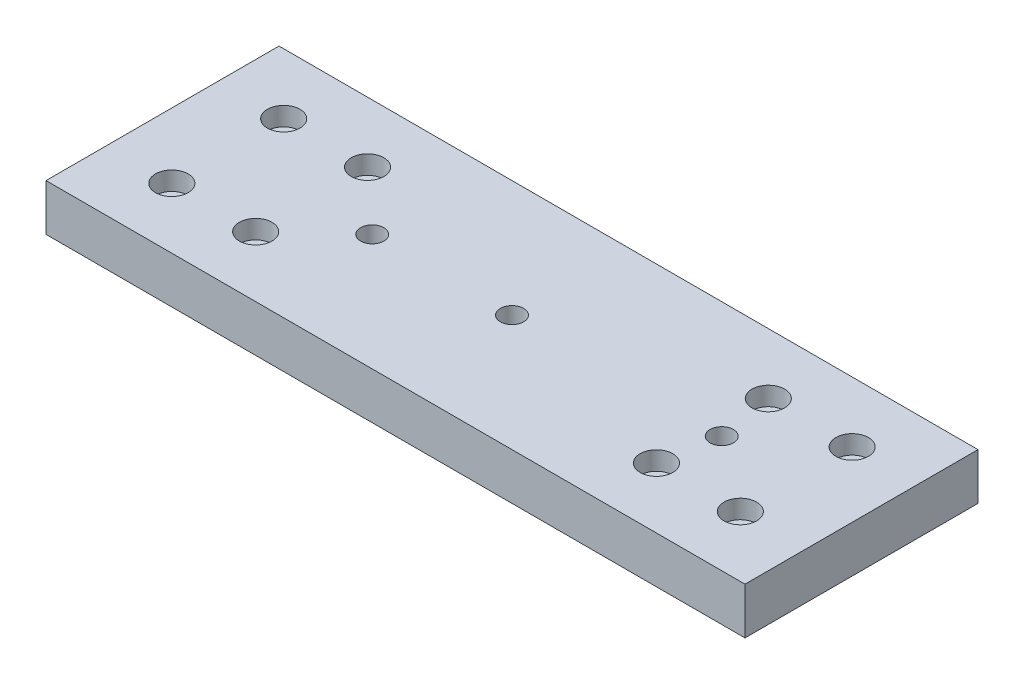
ISO-10303-21;
HEADER;
FILE_DESCRIPTION(('STEP AP214'),'2;1');
FILE_NAME('part.step','',(''),(''),'','','');
FILE_SCHEMA(('AUTOMOTIVE_DESIGN { 1 0 10303 214 1 1 1 1 }'));
ENDSEC;
DATA;
#1=APPLICATION_CONTEXT('core data for automotive mechanical design processes');
#2=APPLICATION_PROTOCOL_DEFINITION('international standard','automotive_design',2000,#1);
#3=PRODUCT_CONTEXT('',#1,'mechanical');
#4=PRODUCT('Part','Part','',(#3));
#5=PRODUCT_RELATED_PRODUCT_CATEGORY('part','',(#4));
#6=PRODUCT_DEFINITION_FORMATION('','',#4);
#7=PRODUCT_DEFINITION_CONTEXT('part definition',#1,'design');
#8=PRODUCT_DEFINITION('design','',#6,#7);
#9=PRODUCT_DEFINITION_SHAPE('','',#8);
#10=(LENGTH_UNIT() NAMED_UNIT(*) SI_UNIT(.MILLI.,.METRE.));
#11=(NAMED_UNIT(*) PLANE_ANGLE_UNIT() SI_UNIT($,.RADIAN.));
#12=(NAMED_UNIT(*) SI_UNIT($,.STERADIAN.) SOLID_ANGLE_UNIT());
#13=UNCERTAINTY_MEASURE_WITH_UNIT(LENGTH_MEASURE(1.E-05),#10,'distance_accuracy_value','');
#14=(GEOMETRIC_REPRESENTATION_CONTEXT(3) GLOBAL_UNCERTAINTY_ASSIGNED_CONTEXT((#13)) GLOBAL_UNIT_ASSIGNED_CONTEXT((#10,
#11,#12)) REPRESENTATION_CONTEXT('',''));
#15=CARTESIAN_POINT('',(0.,0.,0.));
#16=DIRECTION('',(0.,0.,1.));
#17=DIRECTION('',(1.,0.,0.));
#18=AXIS2_PLACEMENT_3D('',#15,#16,#17);
#19=CARTESIAN_POINT('',(-60.9999999999994,0.,-11.9999999999998));
#20=DIRECTION('',(0.,1.,0.));
#21=DIRECTION('',(0.,0.,1.));
#22=AXIS2_PLACEMENT_3D('',#19,#20,#21);
#23=CYLINDRICAL_SURFACE('',#22,1.5);
#24=CARTESIAN_POINT('',(-60.9999999999994,0.,-11.9999999999998));
#25=DIRECTION('',(0.,1.,0.));
#26=DIRECTION('',(0.,0.,1.));
#27=AXIS2_PLACEMENT_3D('',#24,#25,#26);
#28=CIRCLE('',#27,1.5);
#29=CARTESIAN_POINT('',(-60.9999999999994,0.,-10.4999999999998));
#30=VERTEX_POINT('',#29);
#31=EDGE_CURVE('E172',#30,#30,#28,.T.);
#32=ORIENTED_EDGE('',*,*,#31,.F.);
#33=EDGE_LOOP('',(#32));
#34=FACE_BOUND('',#33,.T.);
#35=CARTESIAN_POINT('',(-60.9999999999994,6.,-11.9999999999998));
#36=DIRECTION('',(0.,1.,0.));
#37=DIRECTION('',(0.,0.,1.));
#38=AXIS2_PLACEMENT_3D('',#35,#36,#37);
#39=CIRCLE('',#38,1.5);
#40=CARTESIAN_POINT('',(-60.9999999999994,6.,-10.4999999999998));
#41=VERTEX_POINT('',#40);
#42=EDGE_CURVE('E142',#41,#41,#39,.F.);
#43=ORIENTED_EDGE('',*,*,#42,.F.);
#44=EDGE_LOOP('',(#43));
#45=FACE_BOUND('',#44,.T.);
#46=ADVANCED_FACE('F37',(#34,#45),#23,.F.);
#47=CARTESIAN_POINT('',(-42.9999999999994,0.,-11.9999999999998));
#48=DIRECTION('',(0.,1.,0.));
#49=DIRECTION('',(0.,0.,1.));
#50=AXIS2_PLACEMENT_3D('',#47,#48,#49);
#51=CYLINDRICAL_SURFACE('',#50,1.5);
#52=CARTESIAN_POINT('',(-42.9999999999994,0.,-11.9999999999998));
#53=DIRECTION('',(0.,1.,0.));
#54=DIRECTION('',(0.,0.,1.));
#55=AXIS2_PLACEMENT_3D('',#52,#53,#54);
#56=CIRCLE('',#55,1.5);
#57=CARTESIAN_POINT('',(-42.9999999999994,0.,-10.4999999999998));
#58=VERTEX_POINT('',#57);
#59=EDGE_CURVE('E168',#58,#58,#56,.T.);
#60=ORIENTED_EDGE('',*,*,#59,.F.);
#61=EDGE_LOOP('',(#60));
#62=FACE_BOUND('',#61,.T.);
#63=CARTESIAN_POINT('',(-42.9999999999994,6.,-11.9999999999998));
#64=DIRECTION('',(0.,1.,0.));
#65=DIRECTION('',(0.,0.,1.));
#66=AXIS2_PLACEMENT_3D('',#63,#64,#65);
#67=CIRCLE('',#66,1.5);
#68=CARTESIAN_POINT('',(-42.9999999999994,6.,-10.4999999999998));
#69=VERTEX_POINT('',#68);
#70=EDGE_CURVE('E137',#69,#69,#67,.F.);
#71=ORIENTED_EDGE('',*,*,#70,.F.);
#72=EDGE_LOOP('',(#71));
#73=FACE_BOUND('',#72,.T.);
#74=ADVANCED_FACE('F211',(#62,#73),#51,.F.);
#75=CARTESIAN_POINT('',(60.9999999999994,0.,11.9999999999998));
#76=DIRECTION('',(0.,1.,0.));
#77=DIRECTION('',(0.,0.,1.));
#78=AXIS2_PLACEMENT_3D('',#75,#76,#77);
#79=CYLINDRICAL_SURFACE('',#78,1.5);
#80=CARTESIAN_POINT('',(60.9999999999994,0.,11.9999999999998));
#81=DIRECTION('',(0.,1.,0.));
#82=DIRECTION('',(0.,0.,1.));
#83=AXIS2_PLACEMENT_3D('',#80,#81,#82);
#84=CIRCLE('',#83,1.5);
#85=CARTESIAN_POINT('',(60.9999999999994,0.,13.4999999999998));
#86=VERTEX_POINT('',#85);
#87=EDGE_CURVE('E184',#86,#86,#84,.T.);
#88=ORIENTED_EDGE('',*,*,#87,.F.);
#89=EDGE_LOOP('',(#88));
#90=FACE_BOUND('',#89,.T.);
#91=CARTESIAN_POINT('',(60.9999999999994,6.,11.9999999999998));
#92=DIRECTION('',(0.,1.,0.));
#93=DIRECTION('',(0.,0.,1.));
#94=AXIS2_PLACEMENT_3D('',#91,#92,#93);
#95=CIRCLE('',#94,1.5);
#96=CARTESIAN_POINT('',(60.9999999999994,6.,13.4999999999998));
#97=VERTEX_POINT('',#96);
#98=EDGE_CURVE('E131',#97,#97,#95,.F.);
#99=ORIENTED_EDGE('',*,*,#98,.F.);
#100=EDGE_LOOP('',(#99));
#101=FACE_BOUND('',#100,.T.);
#102=ADVANCED_FACE('F217',(#90,#101),#79,.F.);
#103=CARTESIAN_POINT('',(42.9999999999994,0.,11.9999999999998));
#104=DIRECTION('',(0.,1.,0.));
#105=DIRECTION('',(0.,0.,1.));
#106=AXIS2_PLACEMENT_3D('',#103,#104,#105);
#107=CYLINDRICAL_SURFACE('',#106,1.5);
#108=CARTESIAN_POINT('',(42.9999999999994,0.,11.9999999999998));
#109=DIRECTION('',(0.,1.,0.));
#110=DIRECTION('',(0.,0.,1.));
#111=AXIS2_PLACEMENT_3D('',#108,#109,#110);
#112=CIRCLE('',#111,1.5);
#113=CARTESIAN_POINT('',(42.9999999999994,0.,13.4999999999998));
#114=VERTEX_POINT('',#113);
#115=EDGE_CURVE('E181',#114,#114,#112,.T.);
#116=ORIENTED_EDGE('',*,*,#115,.F.);
#117=EDGE_LOOP('',(#116));
#118=FACE_BOUND('',#117,.T.);
#119=CARTESIAN_POINT('',(42.9999999999994,6.,11.9999999999998));
#120=DIRECTION('',(0.,1.,0.));
#121=DIRECTION('',(0.,0.,1.));
#122=AXIS2_PLACEMENT_3D('',#119,#120,#121);
#123=CIRCLE('',#122,1.5);
#124=CARTESIAN_POINT('',(42.9999999999994,6.,13.4999999999998));
#125=VERTEX_POINT('',#124);
#126=EDGE_CURVE('E127',#125,#125,#123,.F.);
#127=ORIENTED_EDGE('',*,*,#126,.F.);
#128=EDGE_LOOP('',(#127));
#129=FACE_BOUND('',#128,.T.);
#130=ADVANCED_FACE('F229',(#118,#129),#107,.F.);
#131=CARTESIAN_POINT('',(0.,10.,0.));
#132=DIRECTION('',(0.,-1.,0.));
#133=DIRECTION('',(0.,0.,-1.));
#134=AXIS2_PLACEMENT_3D('',#131,#132,#133);
#135=CYLINDRICAL_SURFACE('',#134,2.5);
#136=CARTESIAN_POINT('',(0.,10.,0.));
#137=DIRECTION('',(0.,-1.,0.));
#138=DIRECTION('',(0.,0.,-1.));
#139=AXIS2_PLACEMENT_3D('',#136,#137,#138);
#140=CIRCLE('',#139,2.5);
#141=CARTESIAN_POINT('',(0.,10.,-2.5));
#142=VERTEX_POINT('',#141);
#143=EDGE_CURVE('E163',#142,#142,#140,.T.);
#144=ORIENTED_EDGE('',*,*,#143,.F.);
#145=EDGE_LOOP('',(#144));
#146=FACE_BOUND('',#145,.T.);
#147=CARTESIAN_POINT('',(0.,5.,0.));
#148=DIRECTION('',(0.,-1.,0.));
#149=DIRECTION('',(0.,0.,-1.));
#150=AXIS2_PLACEMENT_3D('',#147,#148,#149);
#151=CIRCLE('',#150,2.5);
#152=CARTESIAN_POINT('',(0.,5.,-2.5));
#153=VERTEX_POINT('',#152);
#154=EDGE_CURVE('E120',#153,#153,#151,.F.);
#155=ORIENTED_EDGE('',*,*,#154,.F.);
#156=EDGE_LOOP('',(#155));
#157=FACE_BOUND('',#156,.T.);
#158=ADVANCED_FACE('F232',(#146,#157),#135,.F.);
#159=CARTESIAN_POINT('',(44.9999999999984,10.,0.));
#160=DIRECTION('',(0.,-1.,0.));
#161=DIRECTION('',(0.,0.,-1.));
#162=AXIS2_PLACEMENT_3D('',#159,#160,#161);
#163=CYLINDRICAL_SURFACE('',#162,2.5);
#164=CARTESIAN_POINT('',(44.9999999999984,10.,0.));
#165=DIRECTION('',(0.,-1.,0.));
#166=DIRECTION('',(0.,0.,-1.));
#167=AXIS2_PLACEMENT_3D('',#164,#165,#166);
#168=CIRCLE('',#167,2.5);
#169=CARTESIAN_POINT('',(44.9999999999984,10.,-2.5));
#170=VERTEX_POINT('',#169);
#171=EDGE_CURVE('E160',#170,#170,#168,.T.);
#172=ORIENTED_EDGE('',*,*,#171,.F.);
#173=EDGE_LOOP('',(#172));
#174=FACE_BOUND('',#173,.T.);
#175=CARTESIAN_POINT('',(44.9999999999984,5.,0.));
#176=DIRECTION('',(0.,-1.,0.));
#177=DIRECTION('',(0.,0.,-1.));
#178=AXIS2_PLACEMENT_3D('',#175,#176,#177);
#179=CIRCLE('',#178,2.5);
#180=CARTESIAN_POINT('',(44.9999999999984,5.,-2.5));
#181=VERTEX_POINT('',#180);
#182=EDGE_CURVE('E116',#181,#181,#179,.F.);
#183=ORIENTED_EDGE('',*,*,#182,.F.);
#184=EDGE_LOOP('',(#183));
#185=FACE_BOUND('',#184,.T.);
#186=ADVANCED_FACE('F315',(#174,#185),#163,.F.);
#187=CARTESIAN_POINT('',(-30.,10.,0.));
#188=DIRECTION('',(0.,-1.,0.));
#189=DIRECTION('',(0.,0.,-1.));
#190=AXIS2_PLACEMENT_3D('',#187,#188,#189);
#191=CYLINDRICAL_SURFACE('',#190,2.5);
#192=CARTESIAN_POINT('',(-30.,10.,0.));
#193=DIRECTION('',(0.,-1.,0.));
#194=DIRECTION('',(0.,0.,-1.));
#195=AXIS2_PLACEMENT_3D('',#192,#193,#194);
#196=CIRCLE('',#195,2.5);
#197=CARTESIAN_POINT('',(-30.,10.,-2.5));
#198=VERTEX_POINT('',#197);
#199=EDGE_CURVE('E123',#198,#198,#196,.T.);
#200=ORIENTED_EDGE('',*,*,#199,.F.);
#201=EDGE_LOOP('',(#200));
#202=FACE_BOUND('',#201,.T.);
#203=CARTESIAN_POINT('',(-30.,5.,0.));
#204=DIRECTION('',(0.,-1.,0.));
#205=DIRECTION('',(0.,0.,-1.));
#206=AXIS2_PLACEMENT_3D('',#203,#204,#205);
#207=CIRCLE('',#206,2.5);
#208=CARTESIAN_POINT('',(-30.,5.,-2.5));
#209=VERTEX_POINT('',#208);
#210=EDGE_CURVE('E113',#209,#209,#207,.F.);
#211=ORIENTED_EDGE('',*,*,#210,.F.);
#212=EDGE_LOOP('',(#211));
#213=FACE_BOUND('',#212,.T.);
#214=ADVANCED_FACE('F318',(#202,#213),#191,.F.);
#215=CARTESIAN_POINT('',(-75.,10.,25.));
#216=DIRECTION('',(1.,0.,0.));
#217=DIRECTION('',(0.,0.,-1.));
#218=AXIS2_PLACEMENT_3D('',#215,#216,#217);
#219=PLANE('',#218);
#220=DIRECTION('',(0.,0.,1.));
#221=VECTOR('',#220,1.);
#222=CARTESIAN_POINT('',(-75.,0.,25.));
#223=LINE('',#222,#221);
#224=CARTESIAN_POINT('',(-75.,0.,-25.));
#225=VERTEX_POINT('',#224);
#226=CARTESIAN_POINT('',(-75.,0.,25.));
#227=VERTEX_POINT('',#226);
#228=EDGE_CURVE('E104',#225,#227,#223,.T.);
#229=ORIENTED_EDGE('',*,*,#228,.T.);
#230=DIRECTION('',(0.,-1.,0.));
#231=VECTOR('',#230,1.);
#232=CARTESIAN_POINT('',(-75.,10.,25.));
#233=LINE('',#232,#231);
#234=CARTESIAN_POINT('',(-75.,10.,25.));
#235=VERTEX_POINT('',#234);
#236=EDGE_CURVE('E11',#235,#227,#233,.T.);
#237=ORIENTED_EDGE('',*,*,#236,.F.);
#238=DIRECTION('',(0.,0.,1.));
#239=VECTOR('',#238,1.);
#240=CARTESIAN_POINT('',(-75.,10.,25.));
#241=LINE('',#240,#239);
#242=CARTESIAN_POINT('',(-75.,10.,-25.));
#243=VERTEX_POINT('',#242);
#244=EDGE_CURVE('E91',#243,#235,#241,.T.);
#245=ORIENTED_EDGE('',*,*,#244,.F.);
#246=DIRECTION('',(0.,-1.,0.));
#247=VECTOR('',#246,1.);
#248=CARTESIAN_POINT('',(-75.,10.,-25.));
#249=LINE('',#248,#247);
#250=EDGE_CURVE('E100',#243,#225,#249,.T.);
#251=ORIENTED_EDGE('',*,*,#250,.T.);
#252=EDGE_LOOP('',(#229,#237,#245,#251));
#253=FACE_BOUND('',#252,.T.);
#254=ADVANCED_FACE('F39',(#253),#219,.F.);
#255=CARTESIAN_POINT('',(75.,10.,25.));
#256=DIRECTION('',(0.,0.,-1.));
#257=DIRECTION('',(-1.,0.,0.));
#258=AXIS2_PLACEMENT_3D('',#255,#256,#257);
#259=PLANE('',#258);
#260=DIRECTION('',(1.,0.,0.));
#261=VECTOR('',#260,1.);
#262=CARTESIAN_POINT('',(75.,0.,25.));
#263=LINE('',#262,#261);
#264=CARTESIAN_POINT('',(75.,0.,25.));
#265=VERTEX_POINT('',#264);
#266=EDGE_CURVE('E95',#227,#265,#263,.T.);
#267=ORIENTED_EDGE('',*,*,#266,.T.);
#268=DIRECTION('',(0.,-1.,0.));
#269=VECTOR('',#268,1.);
#270=CARTESIAN_POINT('',(75.,10.,25.));
#271=LINE('',#270,#269);
#272=CARTESIAN_POINT('',(75.,10.,25.));
#273=VERTEX_POINT('',#272);
#274=EDGE_CURVE('E47',#273,#265,#271,.T.);
#275=ORIENTED_EDGE('',*,*,#274,.F.);
#276=DIRECTION('',(1.,0.,0.));
#277=VECTOR('',#276,1.);
#278=CARTESIAN_POINT('',(75.,10.,25.));
#279=LINE('',#278,#277);
#280=EDGE_CURVE('E86',#235,#273,#279,.T.);
#281=ORIENTED_EDGE('',*,*,#280,.F.);
#282=ORIENTED_EDGE('',*,*,#236,.T.);
#283=EDGE_LOOP('',(#267,#275,#281,#282));
#284=FACE_BOUND('',#283,.T.);
#285=ADVANCED_FACE('F94',(#284),#259,.F.);
#286=CARTESIAN_POINT('',(75.,10.,25.));
#287=DIRECTION('',(-1.,0.,0.));
#288=DIRECTION('',(0.,0.,1.));
#289=AXIS2_PLACEMENT_3D('',#286,#287,#288);
#290=PLANE('',#289);
#291=DIRECTION('',(0.,0.,-1.));
#292=VECTOR('',#291,1.);
#293=CARTESIAN_POINT('',(75.,0.,25.));
#294=LINE('',#293,#292);
#295=CARTESIAN_POINT('',(75.,0.,-25.));
#296=VERTEX_POINT('',#295);
#297=EDGE_CURVE('E73',#265,#296,#294,.T.);
#298=ORIENTED_EDGE('',*,*,#297,.T.);
#299=DIRECTION('',(0.,-1.,0.));
#300=VECTOR('',#299,1.);
#301=CARTESIAN_POINT('',(75.,10.,-25.));
#302=LINE('',#301,#300);
#303=CARTESIAN_POINT('',(75.,10.,-25.));
#304=VERTEX_POINT('',#303);
#305=EDGE_CURVE('E96',#304,#296,#302,.T.);
#306=ORIENTED_EDGE('',*,*,#305,.F.);
#307=DIRECTION('',(0.,0.,-1.));
#308=VECTOR('',#307,1.);
#309=CARTESIAN_POINT('',(75.,10.,25.));
#310=LINE('',#309,#308);
#311=EDGE_CURVE('E89',#273,#304,#310,.T.);
#312=ORIENTED_EDGE('',*,*,#311,.F.);
#313=ORIENTED_EDGE('',*,*,#274,.T.);
#314=EDGE_LOOP('',(#298,#306,#312,#313));
#315=FACE_BOUND('',#314,.T.);
#316=ADVANCED_FACE('F98',(#315),#290,.F.);
#317=CARTESIAN_POINT('',(75.,10.,-25.));
#318=DIRECTION('',(0.,0.,1.));
#319=DIRECTION('',(1.,0.,0.));
#320=AXIS2_PLACEMENT_3D('',#317,#318,#319);
#321=PLANE('',#320);
#322=DIRECTION('',(-1.,0.,0.));
#323=VECTOR('',#322,1.);
#324=CARTESIAN_POINT('',(75.,0.,-25.));
#325=LINE('',#324,#323);
#326=EDGE_CURVE('E79',#296,#225,#325,.T.);
#327=ORIENTED_EDGE('',*,*,#326,.T.);
#328=ORIENTED_EDGE('',*,*,#250,.F.);
#329=DIRECTION('',(-1.,0.,0.));
#330=VECTOR('',#329,1.);
#331=CARTESIAN_POINT('',(75.,10.,-25.));
#332=LINE('',#331,#330);
#333=EDGE_CURVE('E56',#304,#243,#332,.T.);
#334=ORIENTED_EDGE('',*,*,#333,.F.);
#335=ORIENTED_EDGE('',*,*,#305,.T.);
#336=EDGE_LOOP('',(#327,#328,#334,#335));
#337=FACE_BOUND('',#336,.T.);
#338=ADVANCED_FACE('F332',(#337),#321,.F.);
#339=CARTESIAN_POINT('',(0.,10.,0.));
#340=DIRECTION('',(0.,1.,0.));
#341=DIRECTION('',(0.,0.,1.));
#342=AXIS2_PLACEMENT_3D('',#339,#340,#341);
#343=PLANE('',#342);
#344=CARTESIAN_POINT('',(60.9999999999994,10.,11.9999999999998));
#345=DIRECTION('',(0.,1.,0.));
#346=DIRECTION('',(0.,0.,1.));
#347=AXIS2_PLACEMENT_3D('',#344,#345,#346);
#348=CIRCLE('',#347,3.50000000000001);
#349=CARTESIAN_POINT('',(60.9999999999994,10.,15.4999999999998));
#350=VERTEX_POINT('',#349);
#351=EDGE_CURVE('E570',#350,#350,#348,.T.);
#352=ORIENTED_EDGE('',*,*,#351,.F.);
#353=EDGE_LOOP('',(#352));
#354=FACE_BOUND('',#353,.T.);
#355=CARTESIAN_POINT('',(-60.9999999999994,10.,11.9999999999998));
#356=DIRECTION('',(0.,1.,0.));
#357=DIRECTION('',(0.,0.,-1.));
#358=AXIS2_PLACEMENT_3D('',#355,#356,#357);
#359=CIRCLE('',#358,3.5);
#360=CARTESIAN_POINT('',(-60.9999999999994,10.,8.49999999999979));
#361=VERTEX_POINT('',#360);
#362=EDGE_CURVE('E564',#361,#361,#359,.T.);
#363=ORIENTED_EDGE('',*,*,#362,.F.);
#364=EDGE_LOOP('',(#363));
#365=FACE_BOUND('',#364,.T.);
#366=CARTESIAN_POINT('',(-42.9999999999994,10.,11.9999999999998));
#367=DIRECTION('',(0.,1.,0.));
#368=DIRECTION('',(0.,0.,-1.));
#369=AXIS2_PLACEMENT_3D('',#366,#367,#368);
#370=CIRCLE('',#369,3.5);
#371=CARTESIAN_POINT('',(-42.9999999999994,10.,8.49999999999978));
#372=VERTEX_POINT('',#371);
#373=EDGE_CURVE('E563',#372,#372,#370,.T.);
#374=ORIENTED_EDGE('',*,*,#373,.F.);
#375=EDGE_LOOP('',(#374));
#376=FACE_BOUND('',#375,.T.);
#377=CARTESIAN_POINT('',(-42.9999999999994,10.,-11.9999999999998));
#378=DIRECTION('',(0.,1.,0.));
#379=DIRECTION('',(0.,0.,1.));
#380=AXIS2_PLACEMENT_3D('',#377,#378,#379);
#381=CIRCLE('',#380,3.5);
#382=CARTESIAN_POINT('',(-42.9999999999994,10.,-8.49999999999977));
#383=VERTEX_POINT('',#382);
#384=EDGE_CURVE('E577',#383,#383,#381,.T.);
#385=ORIENTED_EDGE('',*,*,#384,.F.);
#386=EDGE_LOOP('',(#385));
#387=FACE_BOUND('',#386,.T.);
#388=CARTESIAN_POINT('',(42.9999999999995,10.,11.9999999999998));
#389=DIRECTION('',(0.,1.,0.));
#390=DIRECTION('',(0.,0.,1.));
#391=AXIS2_PLACEMENT_3D('',#388,#389,#390);
#392=CIRCLE('',#391,3.5);
#393=CARTESIAN_POINT('',(42.9999999999995,10.,15.4999999999998));
#394=VERTEX_POINT('',#393);
#395=EDGE_CURVE('E551',#394,#394,#392,.T.);
#396=ORIENTED_EDGE('',*,*,#395,.F.);
#397=EDGE_LOOP('',(#396));
#398=FACE_BOUND('',#397,.T.);
#399=CARTESIAN_POINT('',(42.9999999999994,10.,-11.9999999999998));
#400=DIRECTION('',(0.,1.,0.));
#401=DIRECTION('',(0.,0.,-1.));
#402=AXIS2_PLACEMENT_3D('',#399,#400,#401);
#403=CIRCLE('',#402,3.5);
#404=CARTESIAN_POINT('',(42.9999999999994,10.,-15.4999999999998));
#405=VERTEX_POINT('',#404);
#406=EDGE_CURVE('E547',#405,#405,#403,.T.);
#407=ORIENTED_EDGE('',*,*,#406,.F.);
#408=EDGE_LOOP('',(#407));
#409=FACE_BOUND('',#408,.T.);
#410=CARTESIAN_POINT('',(60.9999999999994,10.,-11.9999999999998));
#411=DIRECTION('',(0.,1.,0.));
#412=DIRECTION('',(0.,0.,-1.));
#413=AXIS2_PLACEMENT_3D('',#410,#411,#412);
#414=CIRCLE('',#413,3.49999999999999);
#415=CARTESIAN_POINT('',(60.9999999999994,10.,-15.4999999999998));
#416=VERTEX_POINT('',#415);
#417=EDGE_CURVE('E554',#416,#416,#414,.T.);
#418=ORIENTED_EDGE('',*,*,#417,.F.);
#419=EDGE_LOOP('',(#418));
#420=FACE_BOUND('',#419,.T.);
#421=CARTESIAN_POINT('',(-60.9999999999994,10.,-11.9999999999998));
#422=DIRECTION('',(0.,1.,0.));
#423=DIRECTION('',(0.,0.,1.));
#424=AXIS2_PLACEMENT_3D('',#421,#422,#423);
#425=CIRCLE('',#424,3.5);
#426=CARTESIAN_POINT('',(-60.9999999999994,10.,-8.49999999999977));
#427=VERTEX_POINT('',#426);
#428=EDGE_CURVE('E576',#427,#427,#425,.T.);
#429=ORIENTED_EDGE('',*,*,#428,.F.);
#430=EDGE_LOOP('',(#429));
#431=FACE_BOUND('',#430,.T.);
#432=ORIENTED_EDGE('',*,*,#199,.T.);
#433=EDGE_LOOP('',(#432));
#434=FACE_BOUND('',#433,.T.);
#435=ORIENTED_EDGE('',*,*,#171,.T.);
#436=EDGE_LOOP('',(#435));
#437=FACE_BOUND('',#436,.T.);
#438=ORIENTED_EDGE('',*,*,#143,.T.);
#439=EDGE_LOOP('',(#438));
#440=FACE_BOUND('',#439,.T.);
#441=ORIENTED_EDGE('',*,*,#244,.T.);
#442=ORIENTED_EDGE('',*,*,#280,.T.);
#443=ORIENTED_EDGE('',*,*,#311,.T.);
#444=ORIENTED_EDGE('',*,*,#333,.T.);
#445=EDGE_LOOP('',(#441,#442,#443,#444));
#446=FACE_BOUND('',#445,.T.);
#447=ADVANCED_FACE('F87',(#354,#365,#376,#387,#398,#409,#420,#431,#434,#437,#440,#446),#343,.T.);
#448=CARTESIAN_POINT('',(0.,0.,0.));
#449=DIRECTION('',(0.,1.,0.));
#450=DIRECTION('',(0.,0.,1.));
#451=AXIS2_PLACEMENT_3D('',#448,#449,#450);
#452=PLANE('',#451);
#453=CARTESIAN_POINT('',(44.9999999999984,0.,0.));
#454=DIRECTION('',(0.,-1.,0.));
#455=DIRECTION('',(0.,0.,-1.));
#456=AXIS2_PLACEMENT_3D('',#453,#454,#455);
#457=CIRCLE('',#456,4.25000000000001);
#458=CARTESIAN_POINT('',(44.9999999999984,0.,-4.25000000000001));
#459=VERTEX_POINT('',#458);
#460=EDGE_CURVE('E591',#459,#459,#457,.T.);
#461=ORIENTED_EDGE('',*,*,#460,.F.);
#462=EDGE_LOOP('',(#461));
#463=FACE_BOUND('',#462,.T.);
#464=CARTESIAN_POINT('',(0.,0.,0.));
#465=DIRECTION('',(0.,-1.,0.));
#466=DIRECTION('',(0.,0.,-1.));
#467=AXIS2_PLACEMENT_3D('',#464,#465,#466);
#468=CIRCLE('',#467,4.25);
#469=CARTESIAN_POINT('',(0.,0.,-4.25));
#470=VERTEX_POINT('',#469);
#471=EDGE_CURVE('E156',#470,#470,#468,.T.);
#472=ORIENTED_EDGE('',*,*,#471,.F.);
#473=EDGE_LOOP('',(#472));
#474=FACE_BOUND('',#473,.T.);
#475=CARTESIAN_POINT('',(-30.,0.,0.));
#476=DIRECTION('',(0.,-1.,0.));
#477=DIRECTION('',(0.,0.,-1.));
#478=AXIS2_PLACEMENT_3D('',#475,#476,#477);
#479=CIRCLE('',#478,4.25);
#480=CARTESIAN_POINT('',(-30.,0.,-4.25));
#481=VERTEX_POINT('',#480);
#482=EDGE_CURVE('E147',#481,#481,#479,.T.);
#483=ORIENTED_EDGE('',*,*,#482,.F.);
#484=EDGE_LOOP('',(#483));
#485=FACE_BOUND('',#484,.T.);
#486=CARTESIAN_POINT('',(-60.9999999999994,0.,11.9999999999998));
#487=DIRECTION('',(0.,1.,0.));
#488=DIRECTION('',(0.,0.,-1.));
#489=AXIS2_PLACEMENT_3D('',#486,#487,#488);
#490=CIRCLE('',#489,1.5);
#491=CARTESIAN_POINT('',(-60.9999999999994,0.,10.4999999999998));
#492=VERTEX_POINT('',#491);
#493=EDGE_CURVE('E178',#492,#492,#490,.T.);
#494=ORIENTED_EDGE('',*,*,#493,.T.);
#495=EDGE_LOOP('',(#494));
#496=FACE_BOUND('',#495,.T.);
#497=ORIENTED_EDGE('',*,*,#115,.T.);
#498=EDGE_LOOP('',(#497));
#499=FACE_BOUND('',#498,.T.);
#500=ORIENTED_EDGE('',*,*,#87,.T.);
#501=EDGE_LOOP('',(#500));
#502=FACE_BOUND('',#501,.T.);
#503=CARTESIAN_POINT('',(60.9999999999994,0.,-11.9999999999998));
#504=DIRECTION('',(0.,1.,0.));
#505=DIRECTION('',(0.,0.,-1.));
#506=AXIS2_PLACEMENT_3D('',#503,#504,#505);
#507=CIRCLE('',#506,1.50000000000001);
#508=CARTESIAN_POINT('',(60.9999999999994,0.,-13.4999999999998));
#509=VERTEX_POINT('',#508);
#510=EDGE_CURVE('E175',#509,#509,#507,.T.);
#511=ORIENTED_EDGE('',*,*,#510,.T.);
#512=EDGE_LOOP('',(#511));
#513=FACE_BOUND('',#512,.T.);
#514=ORIENTED_EDGE('',*,*,#59,.T.);
#515=EDGE_LOOP('',(#514));
#516=FACE_BOUND('',#515,.T.);
#517=CARTESIAN_POINT('',(42.9999999999994,0.,-11.9999999999998));
#518=DIRECTION('',(0.,1.,0.));
#519=DIRECTION('',(0.,0.,-1.));
#520=AXIS2_PLACEMENT_3D('',#517,#518,#519);
#521=CIRCLE('',#520,1.5);
#522=CARTESIAN_POINT('',(42.9999999999994,0.,-13.4999999999998));
#523=VERTEX_POINT('',#522);
#524=EDGE_CURVE('E171',#523,#523,#521,.T.);
#525=ORIENTED_EDGE('',*,*,#524,.T.);
#526=EDGE_LOOP('',(#525));
#527=FACE_BOUND('',#526,.T.);
#528=ORIENTED_EDGE('',*,*,#31,.T.);
#529=EDGE_LOOP('',(#528));
#530=FACE_BOUND('',#529,.T.);
#531=CARTESIAN_POINT('',(-42.9999999999994,0.,11.9999999999998));
#532=DIRECTION('',(0.,1.,0.));
#533=DIRECTION('',(0.,0.,-1.));
#534=AXIS2_PLACEMENT_3D('',#531,#532,#533);
#535=CIRCLE('',#534,1.5);
#536=CARTESIAN_POINT('',(-42.9999999999994,0.,10.4999999999998));
#537=VERTEX_POINT('',#536);
#538=EDGE_CURVE('E107',#537,#537,#535,.T.);
#539=ORIENTED_EDGE('',*,*,#538,.T.);
#540=EDGE_LOOP('',(#539));
#541=FACE_BOUND('',#540,.T.);
#542=ORIENTED_EDGE('',*,*,#228,.F.);
#543=ORIENTED_EDGE('',*,*,#326,.F.);
#544=ORIENTED_EDGE('',*,*,#297,.F.);
#545=ORIENTED_EDGE('',*,*,#266,.F.);
#546=EDGE_LOOP('',(#542,#543,#544,#545));
#547=FACE_BOUND('',#546,.T.);
#548=ADVANCED_FACE('F192',(#463,#474,#485,#496,#499,#502,#513,#516,#527,#530,#541,#547),#452,.F.);
#549=CARTESIAN_POINT('',(-42.9999999999994,0.,11.9999999999998));
#550=DIRECTION('',(0.,1.,0.));
#551=DIRECTION('',(0.,0.,1.));
#552=AXIS2_PLACEMENT_3D('',#549,#550,#551);
#553=CYLINDRICAL_SURFACE('',#552,1.5);
#554=CARTESIAN_POINT('',(-42.9999999999994,6.,11.9999999999998));
#555=DIRECTION('',(0.,-1.,0.));
#556=DIRECTION('',(0.,0.,-1.));
#557=AXIS2_PLACEMENT_3D('',#554,#555,#556);
#558=CIRCLE('',#557,1.5);
#559=CARTESIAN_POINT('',(-42.9999999999994,6.,10.4999999999998));
#560=VERTEX_POINT('',#559);
#561=EDGE_CURVE('E41',#560,#560,#558,.F.);
#562=ORIENTED_EDGE('',*,*,#561,.T.);
#563=EDGE_LOOP('',(#562));
#564=FACE_BOUND('',#563,.T.);
#565=ORIENTED_EDGE('',*,*,#538,.F.);
#566=EDGE_LOOP('',(#565));
#567=FACE_BOUND('',#566,.T.);
#568=ADVANCED_FACE('F195',(#564,#567),#553,.F.);
#569=CARTESIAN_POINT('',(42.9999999999994,0.,-11.9999999999998));
#570=DIRECTION('',(0.,1.,0.));
#571=DIRECTION('',(0.,0.,1.));
#572=AXIS2_PLACEMENT_3D('',#569,#570,#571);
#573=CYLINDRICAL_SURFACE('',#572,1.5);
#574=CARTESIAN_POINT('',(42.9999999999994,6.,-11.9999999999998));
#575=DIRECTION('',(0.,-1.,0.));
#576=DIRECTION('',(0.,0.,-1.));
#577=AXIS2_PLACEMENT_3D('',#574,#575,#576);
#578=CIRCLE('',#577,1.5);
#579=CARTESIAN_POINT('',(42.9999999999994,6.,-13.4999999999998));
#580=VERTEX_POINT('',#579);
#581=EDGE_CURVE('E140',#580,#580,#578,.F.);
#582=ORIENTED_EDGE('',*,*,#581,.T.);
#583=EDGE_LOOP('',(#582));
#584=FACE_BOUND('',#583,.T.);
#585=ORIENTED_EDGE('',*,*,#524,.F.);
#586=EDGE_LOOP('',(#585));
#587=FACE_BOUND('',#586,.T.);
#588=ADVANCED_FACE('F197',(#584,#587),#573,.F.);
#589=CARTESIAN_POINT('',(60.9999999999994,0.,-11.9999999999998));
#590=DIRECTION('',(0.,1.,0.));
#591=DIRECTION('',(0.,0.,1.));
#592=AXIS2_PLACEMENT_3D('',#589,#590,#591);
#593=CYLINDRICAL_SURFACE('',#592,1.50000000000001);
#594=CARTESIAN_POINT('',(60.9999999999994,6.,-11.9999999999998));
#595=DIRECTION('',(0.,-1.,0.));
#596=DIRECTION('',(0.,0.,-1.));
#597=AXIS2_PLACEMENT_3D('',#594,#595,#596);
#598=CIRCLE('',#597,1.50000000000001);
#599=CARTESIAN_POINT('',(60.9999999999994,6.,-13.4999999999998));
#600=VERTEX_POINT('',#599);
#601=EDGE_CURVE('E134',#600,#600,#598,.F.);
#602=ORIENTED_EDGE('',*,*,#601,.T.);
#603=EDGE_LOOP('',(#602));
#604=FACE_BOUND('',#603,.T.);
#605=ORIENTED_EDGE('',*,*,#510,.F.);
#606=EDGE_LOOP('',(#605));
#607=FACE_BOUND('',#606,.T.);
#608=ADVANCED_FACE('F203',(#604,#607),#593,.F.);
#609=CARTESIAN_POINT('',(-60.9999999999994,0.,11.9999999999998));
#610=DIRECTION('',(0.,1.,0.));
#611=DIRECTION('',(0.,0.,1.));
#612=AXIS2_PLACEMENT_3D('',#609,#610,#611);
#613=CYLINDRICAL_SURFACE('',#612,1.5);
#614=CARTESIAN_POINT('',(-60.9999999999994,6.,11.9999999999998));
#615=DIRECTION('',(0.,-1.,0.));
#616=DIRECTION('',(0.,0.,-1.));
#617=AXIS2_PLACEMENT_3D('',#614,#615,#616);
#618=CIRCLE('',#617,1.5);
#619=CARTESIAN_POINT('',(-60.9999999999994,6.,10.4999999999998));
#620=VERTEX_POINT('',#619);
#621=EDGE_CURVE('E124',#620,#620,#618,.F.);
#622=ORIENTED_EDGE('',*,*,#621,.T.);
#623=EDGE_LOOP('',(#622));
#624=FACE_BOUND('',#623,.T.);
#625=ORIENTED_EDGE('',*,*,#493,.F.);
#626=EDGE_LOOP('',(#625));
#627=FACE_BOUND('',#626,.T.);
#628=ADVANCED_FACE('F224',(#624,#627),#613,.F.);
#629=CARTESIAN_POINT('',(-30.,5.,0.));
#630=DIRECTION('',(0.,-1.,0.));
#631=DIRECTION('',(0.,0.,-1.));
#632=AXIS2_PLACEMENT_3D('',#629,#630,#631);
#633=PLANE('',#632);
#634=CARTESIAN_POINT('',(-30.,5.,0.));
#635=DIRECTION('',(0.,-1.,0.));
#636=DIRECTION('',(0.,0.,-1.));
#637=AXIS2_PLACEMENT_3D('',#634,#635,#636);
#638=CIRCLE('',#637,4.25);
#639=CARTESIAN_POINT('',(-30.,5.,-4.25));
#640=VERTEX_POINT('',#639);
#641=EDGE_CURVE('E151',#640,#640,#638,.T.);
#642=ORIENTED_EDGE('',*,*,#641,.T.);
#643=EDGE_LOOP('',(#642));
#644=FACE_BOUND('',#643,.T.);
#645=ORIENTED_EDGE('',*,*,#210,.T.);
#646=EDGE_LOOP('',(#645));
#647=FACE_BOUND('',#646,.T.);
#648=ADVANCED_FACE('F227',(#644,#647),#633,.T.);
#649=CARTESIAN_POINT('',(-30.,5.,0.));
#650=DIRECTION('',(0.,-1.,0.));
#651=DIRECTION('',(0.,0.,-1.));
#652=AXIS2_PLACEMENT_3D('',#649,#650,#651);
#653=CYLINDRICAL_SURFACE('',#652,4.25);
#654=ORIENTED_EDGE('',*,*,#641,.F.);
#655=EDGE_LOOP('',(#654));
#656=FACE_BOUND('',#655,.T.);
#657=ORIENTED_EDGE('',*,*,#482,.T.);
#658=EDGE_LOOP('',(#657));
#659=FACE_BOUND('',#658,.T.);
#660=ADVANCED_FACE('F295',(#656,#659),#653,.F.);
#661=CARTESIAN_POINT('',(44.9999999999984,5.,0.));
#662=DIRECTION('',(0.,-1.,0.));
#663=DIRECTION('',(0.,0.,-1.));
#664=AXIS2_PLACEMENT_3D('',#661,#662,#663);
#665=PLANE('',#664);
#666=CARTESIAN_POINT('',(44.9999999999984,5.,0.));
#667=DIRECTION('',(0.,-1.,0.));
#668=DIRECTION('',(0.,0.,-1.));
#669=AXIS2_PLACEMENT_3D('',#666,#667,#668);
#670=CIRCLE('',#669,4.25000000000001);
#671=CARTESIAN_POINT('',(44.9999999999984,5.,-4.25000000000001));
#672=VERTEX_POINT('',#671);
#673=EDGE_CURVE('E117',#672,#672,#670,.T.);
#674=ORIENTED_EDGE('',*,*,#673,.T.);
#675=EDGE_LOOP('',(#674));
#676=FACE_BOUND('',#675,.T.);
#677=ORIENTED_EDGE('',*,*,#182,.T.);
#678=EDGE_LOOP('',(#677));
#679=FACE_BOUND('',#678,.T.);
#680=ADVANCED_FACE('F291',(#676,#679),#665,.T.);
#681=CARTESIAN_POINT('',(44.9999999999984,5.,0.));
#682=DIRECTION('',(0.,-1.,0.));
#683=DIRECTION('',(0.,0.,-1.));
#684=AXIS2_PLACEMENT_3D('',#681,#682,#683);
#685=CYLINDRICAL_SURFACE('',#684,4.25000000000001);
#686=ORIENTED_EDGE('',*,*,#673,.F.);
#687=EDGE_LOOP('',(#686));
#688=FACE_BOUND('',#687,.T.);
#689=ORIENTED_EDGE('',*,*,#460,.T.);
#690=EDGE_LOOP('',(#689));
#691=FACE_BOUND('',#690,.T.);
#692=ADVANCED_FACE('F294',(#688,#691),#685,.F.);
#693=CARTESIAN_POINT('',(0.,5.,0.));
#694=DIRECTION('',(0.,-1.,0.));
#695=DIRECTION('',(0.,0.,-1.));
#696=AXIS2_PLACEMENT_3D('',#693,#694,#695);
#697=PLANE('',#696);
#698=CARTESIAN_POINT('',(0.,5.,0.));
#699=DIRECTION('',(0.,-1.,0.));
#700=DIRECTION('',(0.,0.,-1.));
#701=AXIS2_PLACEMENT_3D('',#698,#699,#700);
#702=CIRCLE('',#701,4.25);
#703=CARTESIAN_POINT('',(0.,5.,-4.25));
#704=VERTEX_POINT('',#703);
#705=EDGE_CURVE('E594',#704,#704,#702,.T.);
#706=ORIENTED_EDGE('',*,*,#705,.T.);
#707=EDGE_LOOP('',(#706));
#708=FACE_BOUND('',#707,.T.);
#709=ORIENTED_EDGE('',*,*,#154,.T.);
#710=EDGE_LOOP('',(#709));
#711=FACE_BOUND('',#710,.T.);
#712=ADVANCED_FACE('F299',(#708,#711),#697,.T.);
#713=CARTESIAN_POINT('',(0.,5.,0.));
#714=DIRECTION('',(0.,-1.,0.));
#715=DIRECTION('',(0.,0.,-1.));
#716=AXIS2_PLACEMENT_3D('',#713,#714,#715);
#717=CYLINDRICAL_SURFACE('',#716,4.25);
#718=ORIENTED_EDGE('',*,*,#705,.F.);
#719=EDGE_LOOP('',(#718));
#720=FACE_BOUND('',#719,.T.);
#721=ORIENTED_EDGE('',*,*,#471,.T.);
#722=EDGE_LOOP('',(#721));
#723=FACE_BOUND('',#722,.T.);
#724=ADVANCED_FACE('F303',(#720,#723),#717,.F.);
#725=CARTESIAN_POINT('',(-60.9999999999994,6.,11.9999999999998));
#726=DIRECTION('',(0.,-1.,0.));
#727=DIRECTION('',(0.,0.,-1.));
#728=AXIS2_PLACEMENT_3D('',#725,#726,#727);
#729=PLANE('',#728);
#730=CARTESIAN_POINT('',(-60.9999999999994,6.,11.9999999999998));
#731=DIRECTION('',(0.,1.,0.));
#732=DIRECTION('',(0.,0.,-1.));
#733=AXIS2_PLACEMENT_3D('',#730,#731,#732);
#734=CIRCLE('',#733,3.5);
#735=CARTESIAN_POINT('',(-60.9999999999994,6.,8.49999999999979));
#736=VERTEX_POINT('',#735);
#737=EDGE_CURVE('E560',#736,#736,#734,.T.);
#738=ORIENTED_EDGE('',*,*,#737,.T.);
#739=EDGE_LOOP('',(#738));
#740=FACE_BOUND('',#739,.T.);
#741=ORIENTED_EDGE('',*,*,#621,.F.);
#742=EDGE_LOOP('',(#741));
#743=FACE_BOUND('',#742,.T.);
#744=ADVANCED_FACE('F307',(#740,#743),#729,.F.);
#745=CARTESIAN_POINT('',(-60.9999999999994,6.,11.9999999999998));
#746=DIRECTION('',(0.,1.,0.));
#747=DIRECTION('',(0.,0.,1.));
#748=AXIS2_PLACEMENT_3D('',#745,#746,#747);
#749=CYLINDRICAL_SURFACE('',#748,3.5);
#750=ORIENTED_EDGE('',*,*,#737,.F.);
#751=EDGE_LOOP('',(#750));
#752=FACE_BOUND('',#751,.T.);
#753=ORIENTED_EDGE('',*,*,#362,.T.);
#754=EDGE_LOOP('',(#753));
#755=FACE_BOUND('',#754,.T.);
#756=ADVANCED_FACE('F422',(#752,#755),#749,.F.);
#757=CARTESIAN_POINT('',(42.9999999999995,6.,11.9999999999998));
#758=DIRECTION('',(0.,1.,0.));
#759=DIRECTION('',(0.,0.,1.));
#760=AXIS2_PLACEMENT_3D('',#757,#758,#759);
#761=PLANE('',#760);
#762=CARTESIAN_POINT('',(42.9999999999995,6.,11.9999999999998));
#763=DIRECTION('',(0.,1.,0.));
#764=DIRECTION('',(0.,0.,1.));
#765=AXIS2_PLACEMENT_3D('',#762,#763,#764);
#766=CIRCLE('',#765,3.5);
#767=CARTESIAN_POINT('',(42.9999999999995,6.,15.4999999999998));
#768=VERTEX_POINT('',#767);
#769=EDGE_CURVE('E573',#768,#768,#766,.T.);
#770=ORIENTED_EDGE('',*,*,#769,.T.);
#771=EDGE_LOOP('',(#770));
#772=FACE_BOUND('',#771,.T.);
#773=ORIENTED_EDGE('',*,*,#126,.T.);
#774=EDGE_LOOP('',(#773));
#775=FACE_BOUND('',#774,.T.);
#776=ADVANCED_FACE('F433',(#772,#775),#761,.T.);
#777=CARTESIAN_POINT('',(42.9999999999995,6.,11.9999999999998));
#778=DIRECTION('',(0.,1.,0.));
#779=DIRECTION('',(0.,0.,1.));
#780=AXIS2_PLACEMENT_3D('',#777,#778,#779);
#781=CYLINDRICAL_SURFACE('',#780,3.5);
#782=ORIENTED_EDGE('',*,*,#769,.F.);
#783=EDGE_LOOP('',(#782));
#784=FACE_BOUND('',#783,.T.);
#785=ORIENTED_EDGE('',*,*,#395,.T.);
#786=EDGE_LOOP('',(#785));
#787=FACE_BOUND('',#786,.T.);
#788=ADVANCED_FACE('F443',(#784,#787),#781,.F.);
#789=CARTESIAN_POINT('',(60.9999999999994,6.,11.9999999999998));
#790=DIRECTION('',(0.,1.,0.));
#791=DIRECTION('',(0.,0.,1.));
#792=AXIS2_PLACEMENT_3D('',#789,#790,#791);
#793=PLANE('',#792);
#794=CARTESIAN_POINT('',(60.9999999999994,6.,11.9999999999998));
#795=DIRECTION('',(0.,1.,0.));
#796=DIRECTION('',(0.,0.,1.));
#797=AXIS2_PLACEMENT_3D('',#794,#795,#796);
#798=CIRCLE('',#797,3.50000000000001);
#799=CARTESIAN_POINT('',(60.9999999999994,6.,15.4999999999998));
#800=VERTEX_POINT('',#799);
#801=EDGE_CURVE('E567',#800,#800,#798,.T.);
#802=ORIENTED_EDGE('',*,*,#801,.T.);
#803=EDGE_LOOP('',(#802));
#804=FACE_BOUND('',#803,.T.);
#805=ORIENTED_EDGE('',*,*,#98,.T.);
#806=EDGE_LOOP('',(#805));
#807=FACE_BOUND('',#806,.T.);
#808=ADVANCED_FACE('F453',(#804,#807),#793,.T.);
#809=CARTESIAN_POINT('',(60.9999999999994,6.,11.9999999999998));
#810=DIRECTION('',(0.,1.,0.));
#811=DIRECTION('',(0.,0.,1.));
#812=AXIS2_PLACEMENT_3D('',#809,#810,#811);
#813=CYLINDRICAL_SURFACE('',#812,3.50000000000001);
#814=ORIENTED_EDGE('',*,*,#801,.F.);
#815=EDGE_LOOP('',(#814));
#816=FACE_BOUND('',#815,.T.);
#817=ORIENTED_EDGE('',*,*,#351,.T.);
#818=EDGE_LOOP('',(#817));
#819=FACE_BOUND('',#818,.T.);
#820=ADVANCED_FACE('F271',(#816,#819),#813,.F.);
#821=CARTESIAN_POINT('',(60.9999999999994,6.,-11.9999999999998));
#822=DIRECTION('',(0.,-1.,0.));
#823=DIRECTION('',(0.,0.,-1.));
#824=AXIS2_PLACEMENT_3D('',#821,#822,#823);
#825=PLANE('',#824);
#826=CARTESIAN_POINT('',(60.9999999999994,6.,-11.9999999999998));
#827=DIRECTION('',(0.,1.,0.));
#828=DIRECTION('',(0.,0.,-1.));
#829=AXIS2_PLACEMENT_3D('',#826,#827,#828);
#830=CIRCLE('',#829,3.49999999999999);
#831=CARTESIAN_POINT('',(60.9999999999994,6.,-15.4999999999998));
#832=VERTEX_POINT('',#831);
#833=EDGE_CURVE('E549',#832,#832,#830,.T.);
#834=ORIENTED_EDGE('',*,*,#833,.T.);
#835=EDGE_LOOP('',(#834));
#836=FACE_BOUND('',#835,.T.);
#837=ORIENTED_EDGE('',*,*,#601,.F.);
#838=EDGE_LOOP('',(#837));
#839=FACE_BOUND('',#838,.T.);
#840=ADVANCED_FACE('F266',(#836,#839),#825,.F.);
#841=CARTESIAN_POINT('',(60.9999999999994,6.,-11.9999999999998));
#842=DIRECTION('',(0.,1.,0.));
#843=DIRECTION('',(0.,0.,1.));
#844=AXIS2_PLACEMENT_3D('',#841,#842,#843);
#845=CYLINDRICAL_SURFACE('',#844,3.49999999999999);
#846=ORIENTED_EDGE('',*,*,#833,.F.);
#847=EDGE_LOOP('',(#846));
#848=FACE_BOUND('',#847,.T.);
#849=ORIENTED_EDGE('',*,*,#417,.T.);
#850=EDGE_LOOP('',(#849));
#851=FACE_BOUND('',#850,.T.);
#852=ADVANCED_FACE('F256',(#848,#851),#845,.F.);
#853=CARTESIAN_POINT('',(-42.9999999999994,6.,-11.9999999999998));
#854=DIRECTION('',(0.,1.,0.));
#855=DIRECTION('',(0.,0.,1.));
#856=AXIS2_PLACEMENT_3D('',#853,#854,#855);
#857=PLANE('',#856);
#858=CARTESIAN_POINT('',(-42.9999999999994,6.,-11.9999999999998));
#859=DIRECTION('',(0.,1.,0.));
#860=DIRECTION('',(0.,0.,1.));
#861=AXIS2_PLACEMENT_3D('',#858,#859,#860);
#862=CIRCLE('',#861,3.5);
#863=CARTESIAN_POINT('',(-42.9999999999994,6.,-8.49999999999977));
#864=VERTEX_POINT('',#863);
#865=EDGE_CURVE('E574',#864,#864,#862,.T.);
#866=ORIENTED_EDGE('',*,*,#865,.T.);
#867=EDGE_LOOP('',(#866));
#868=FACE_BOUND('',#867,.T.);
#869=ORIENTED_EDGE('',*,*,#70,.T.);
#870=EDGE_LOOP('',(#869));
#871=FACE_BOUND('',#870,.T.);
#872=ADVANCED_FACE('F253',(#868,#871),#857,.T.);
#873=CARTESIAN_POINT('',(-42.9999999999994,6.,-11.9999999999998));
#874=DIRECTION('',(0.,1.,0.));
#875=DIRECTION('',(0.,0.,1.));
#876=AXIS2_PLACEMENT_3D('',#873,#874,#875);
#877=CYLINDRICAL_SURFACE('',#876,3.5);
#878=ORIENTED_EDGE('',*,*,#865,.F.);
#879=EDGE_LOOP('',(#878));
#880=FACE_BOUND('',#879,.T.);
#881=ORIENTED_EDGE('',*,*,#384,.T.);
#882=EDGE_LOOP('',(#881));
#883=FACE_BOUND('',#882,.T.);
#884=ADVANCED_FACE('F255',(#880,#883),#877,.F.);
#885=CARTESIAN_POINT('',(42.9999999999994,6.,-11.9999999999998));
#886=DIRECTION('',(0.,-1.,0.));
#887=DIRECTION('',(0.,0.,-1.));
#888=AXIS2_PLACEMENT_3D('',#885,#886,#887);
#889=PLANE('',#888);
#890=CARTESIAN_POINT('',(42.9999999999994,6.,-11.9999999999998));
#891=DIRECTION('',(0.,1.,0.));
#892=DIRECTION('',(0.,0.,-1.));
#893=AXIS2_PLACEMENT_3D('',#890,#891,#892);
#894=CIRCLE('',#893,3.5);
#895=CARTESIAN_POINT('',(42.9999999999994,6.,-15.4999999999998));
#896=VERTEX_POINT('',#895);
#897=EDGE_CURVE('E544',#896,#896,#894,.T.);
#898=ORIENTED_EDGE('',*,*,#897,.T.);
#899=EDGE_LOOP('',(#898));
#900=FACE_BOUND('',#899,.T.);
#901=ORIENTED_EDGE('',*,*,#581,.F.);
#902=EDGE_LOOP('',(#901));
#903=FACE_BOUND('',#902,.T.);
#904=ADVANCED_FACE('F263',(#900,#903),#889,.F.);
#905=CARTESIAN_POINT('',(42.9999999999994,6.,-11.9999999999998));
#906=DIRECTION('',(0.,1.,0.));
#907=DIRECTION('',(0.,0.,1.));
#908=AXIS2_PLACEMENT_3D('',#905,#906,#907);
#909=CYLINDRICAL_SURFACE('',#908,3.5);
#910=ORIENTED_EDGE('',*,*,#897,.F.);
#911=EDGE_LOOP('',(#910));
#912=FACE_BOUND('',#911,.T.);
#913=ORIENTED_EDGE('',*,*,#406,.T.);
#914=EDGE_LOOP('',(#913));
#915=FACE_BOUND('',#914,.T.);
#916=ADVANCED_FACE('F286',(#912,#915),#909,.F.);
#917=CARTESIAN_POINT('',(-60.9999999999994,6.,-11.9999999999998));
#918=DIRECTION('',(0.,1.,0.));
#919=DIRECTION('',(0.,0.,1.));
#920=AXIS2_PLACEMENT_3D('',#917,#918,#919);
#921=PLANE('',#920);
#922=CARTESIAN_POINT('',(-60.9999999999994,6.,-11.9999999999998));
#923=DIRECTION('',(0.,1.,0.));
#924=DIRECTION('',(0.,0.,1.));
#925=AXIS2_PLACEMENT_3D('',#922,#923,#924);
#926=CIRCLE('',#925,3.5);
#927=CARTESIAN_POINT('',(-60.9999999999994,6.,-8.49999999999977));
#928=VERTEX_POINT('',#927);
#929=EDGE_CURVE('E128',#928,#928,#926,.T.);
#930=ORIENTED_EDGE('',*,*,#929,.T.);
#931=EDGE_LOOP('',(#930));
#932=FACE_BOUND('',#931,.T.);
#933=ORIENTED_EDGE('',*,*,#42,.T.);
#934=EDGE_LOOP('',(#933));
#935=FACE_BOUND('',#934,.T.);
#936=ADVANCED_FACE('F283',(#932,#935),#921,.T.);
#937=CARTESIAN_POINT('',(-60.9999999999994,6.,-11.9999999999998));
#938=DIRECTION('',(0.,1.,0.));
#939=DIRECTION('',(0.,0.,1.));
#940=AXIS2_PLACEMENT_3D('',#937,#938,#939);
#941=CYLINDRICAL_SURFACE('',#940,3.5);
#942=ORIENTED_EDGE('',*,*,#929,.F.);
#943=EDGE_LOOP('',(#942));
#944=FACE_BOUND('',#943,.T.);
#945=ORIENTED_EDGE('',*,*,#428,.T.);
#946=EDGE_LOOP('',(#945));
#947=FACE_BOUND('',#946,.T.);
#948=ADVANCED_FACE('F278',(#944,#947),#941,.F.);
#949=CARTESIAN_POINT('',(-42.9999999999994,6.,11.9999999999998));
#950=DIRECTION('',(0.,-1.,0.));
#951=DIRECTION('',(0.,0.,-1.));
#952=AXIS2_PLACEMENT_3D('',#949,#950,#951);
#953=PLANE('',#952);
#954=CARTESIAN_POINT('',(-42.9999999999994,6.,11.9999999999998));
#955=DIRECTION('',(0.,1.,0.));
#956=DIRECTION('',(0.,0.,-1.));
#957=AXIS2_PLACEMENT_3D('',#954,#955,#956);
#958=CIRCLE('',#957,3.5);
#959=CARTESIAN_POINT('',(-42.9999999999994,6.,8.49999999999978));
#960=VERTEX_POINT('',#959);
#961=EDGE_CURVE('E580',#960,#960,#958,.T.);
#962=ORIENTED_EDGE('',*,*,#961,.T.);
#963=EDGE_LOOP('',(#962));
#964=FACE_BOUND('',#963,.T.);
#965=ORIENTED_EDGE('',*,*,#561,.F.);
#966=EDGE_LOOP('',(#965));
#967=FACE_BOUND('',#966,.T.);
#968=ADVANCED_FACE('F274',(#964,#967),#953,.F.);
#969=CARTESIAN_POINT('',(-42.9999999999994,6.,11.9999999999998));
#970=DIRECTION('',(0.,1.,0.));
#971=DIRECTION('',(0.,0.,1.));
#972=AXIS2_PLACEMENT_3D('',#969,#970,#971);
#973=CYLINDRICAL_SURFACE('',#972,3.5);
#974=ORIENTED_EDGE('',*,*,#961,.F.);
#975=EDGE_LOOP('',(#974));
#976=FACE_BOUND('',#975,.T.);
#977=ORIENTED_EDGE('',*,*,#373,.T.);
#978=EDGE_LOOP('',(#977));
#979=FACE_BOUND('',#978,.T.);
#980=ADVANCED_FACE('F277',(#976,#979),#973,.F.);
#981=CLOSED_SHELL('',(#46,#74,#102,#130,#158,#186,#214,#254,#285,#316,#338,#447,#548,#568,#588,
#608,#628,#648,#660,#680,#692,#712,#724,#744,#756,#776,#788,#808,#820,#840,#852,#872,#884,#904,
#916,#936,#948,#968,#980));
#982=MANIFOLD_SOLID_BREP('B2',#981);
#983=ADVANCED_BREP_SHAPE_REPRESENTATION('',(#18,#982),#14);
#984=SHAPE_DEFINITION_REPRESENTATION(#9,#983);
ENDSEC;
END-ISO-10303-21;
